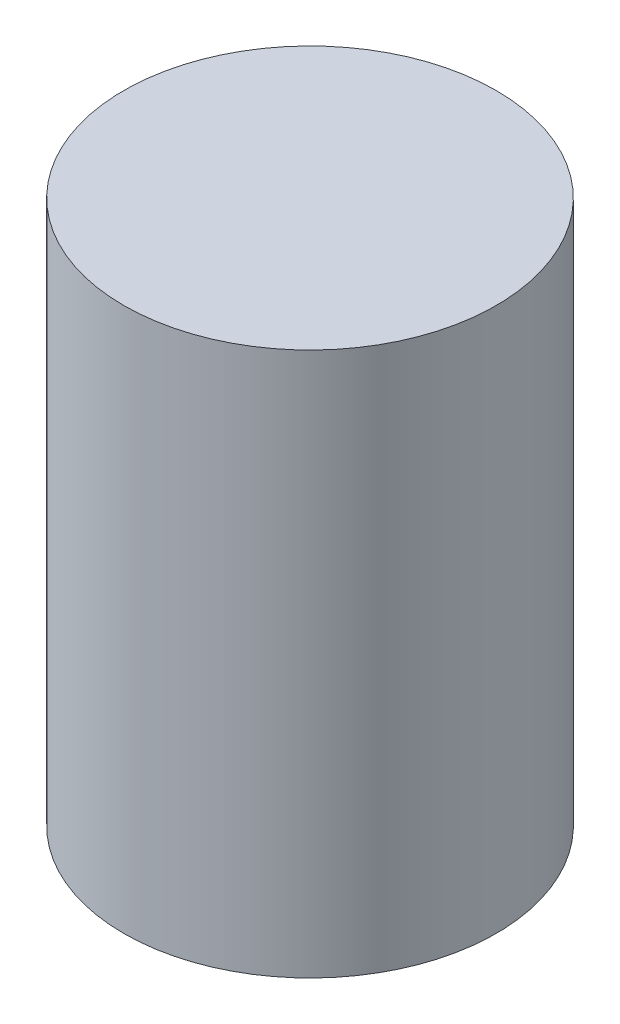
ISO-10303-21;
HEADER;
FILE_DESCRIPTION(('STEP AP214'),'2;1');
FILE_NAME('part.step','',(''),(''),'','','');
FILE_SCHEMA(('AUTOMOTIVE_DESIGN { 1 0 10303 214 1 1 1 1 }'));
ENDSEC;
DATA;
#1=APPLICATION_CONTEXT('core data for automotive mechanical design processes');
#2=APPLICATION_PROTOCOL_DEFINITION('international standard','automotive_design',2000,#1);
#3=PRODUCT_CONTEXT('',#1,'mechanical');
#4=PRODUCT('Part','Part','',(#3));
#5=PRODUCT_RELATED_PRODUCT_CATEGORY('part','',(#4));
#6=PRODUCT_DEFINITION_FORMATION('','',#4);
#7=PRODUCT_DEFINITION_CONTEXT('part definition',#1,'design');
#8=PRODUCT_DEFINITION('design','',#6,#7);
#9=PRODUCT_DEFINITION_SHAPE('','',#8);
#10=(LENGTH_UNIT() NAMED_UNIT(*) SI_UNIT(.MILLI.,.METRE.));
#11=(NAMED_UNIT(*) PLANE_ANGLE_UNIT() SI_UNIT($,.RADIAN.));
#12=(NAMED_UNIT(*) SI_UNIT($,.STERADIAN.) SOLID_ANGLE_UNIT());
#13=UNCERTAINTY_MEASURE_WITH_UNIT(LENGTH_MEASURE(1.E-05),#10,'distance_accuracy_value','');
#14=(GEOMETRIC_REPRESENTATION_CONTEXT(3) GLOBAL_UNCERTAINTY_ASSIGNED_CONTEXT((#13)) GLOBAL_UNIT_ASSIGNED_CONTEXT((#10,
#11,#12)) REPRESENTATION_CONTEXT('',''));
#15=CARTESIAN_POINT('',(0.,0.,0.));
#16=DIRECTION('',(0.,0.,1.));
#17=DIRECTION('',(1.,0.,0.));
#18=AXIS2_PLACEMENT_3D('',#15,#16,#17);
#19=CARTESIAN_POINT('',(0.,46.,0.));
#20=DIRECTION('',(0.,-1.,0.));
#21=DIRECTION('',(0.,0.,-1.));
#22=AXIS2_PLACEMENT_3D('',#19,#20,#21);
#23=CYLINDRICAL_SURFACE('',#22,15.7499999999999);
#24=CARTESIAN_POINT('',(0.,46.,0.));
#25=DIRECTION('',(0.,1.,0.));
#26=DIRECTION('',(0.,0.,1.));
#27=AXIS2_PLACEMENT_3D('',#24,#25,#26);
#28=CIRCLE('',#27,15.7499999999999);
#29=CARTESIAN_POINT('',(0.,46.,15.7499999999999));
#30=VERTEX_POINT('',#29);
#31=EDGE_CURVE('E10',#30,#30,#28,.T.);
#32=ORIENTED_EDGE('',*,*,#31,.F.);
#33=EDGE_LOOP('',(#32));
#34=FACE_BOUND('',#33,.T.);
#35=CARTESIAN_POINT('',(0.,0.,0.));
#36=DIRECTION('',(0.,1.,0.));
#37=DIRECTION('',(0.,0.,1.));
#38=AXIS2_PLACEMENT_3D('',#35,#36,#37);
#39=CIRCLE('',#38,15.7499999999999);
#40=CARTESIAN_POINT('',(0.,0.,15.7499999999999));
#41=VERTEX_POINT('',#40);
#42=EDGE_CURVE('E38',#41,#41,#39,.T.);
#43=ORIENTED_EDGE('',*,*,#42,.T.);
#44=EDGE_LOOP('',(#43));
#45=FACE_BOUND('',#44,.T.);
#46=ADVANCED_FACE('F35',(#34,#45),#23,.T.);
#47=CARTESIAN_POINT('',(0.,46.,0.));
#48=DIRECTION('',(0.,1.,0.));
#49=DIRECTION('',(0.,0.,1.));
#50=AXIS2_PLACEMENT_3D('',#47,#48,#49);
#51=PLANE('',#50);
#52=ORIENTED_EDGE('',*,*,#31,.T.);
#53=EDGE_LOOP('',(#52));
#54=FACE_BOUND('',#53,.T.);
#55=ADVANCED_FACE('F50',(#54),#51,.T.);
#56=CARTESIAN_POINT('',(0.,0.,0.));
#57=DIRECTION('',(0.,1.,0.));
#58=DIRECTION('',(0.,0.,1.));
#59=AXIS2_PLACEMENT_3D('',#56,#57,#58);
#60=PLANE('',#59);
#61=ORIENTED_EDGE('',*,*,#42,.F.);
#62=EDGE_LOOP('',(#61));
#63=FACE_BOUND('',#62,.T.);
#64=ADVANCED_FACE('F48',(#63),#60,.F.);
#65=CLOSED_SHELL('',(#46,#55,#64));
#66=MANIFOLD_SOLID_BREP('B2',#65);
#67=ADVANCED_BREP_SHAPE_REPRESENTATION('',(#18,#66),#14);
#68=SHAPE_DEFINITION_REPRESENTATION(#9,#67);
ENDSEC;
END-ISO-10303-21;
